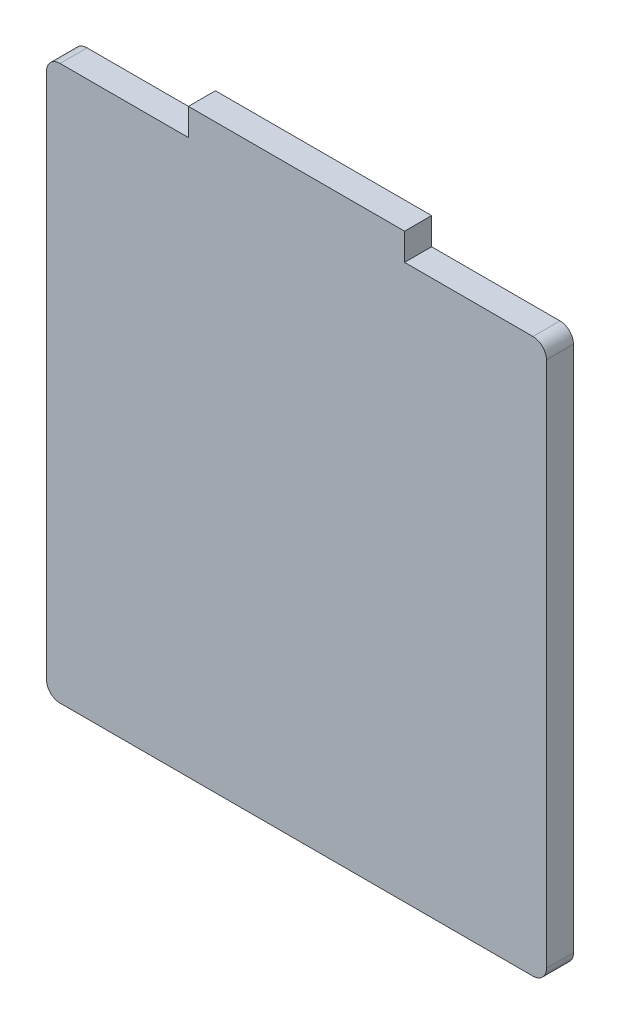
ISO-10303-21;
HEADER;
FILE_DESCRIPTION(('STEP AP214'),'2;1');
FILE_NAME('part.step','',(''),(''),'','','');
FILE_SCHEMA(('AUTOMOTIVE_DESIGN { 1 0 10303 214 1 1 1 1 }'));
ENDSEC;
DATA;
#1=APPLICATION_CONTEXT('core data for automotive mechanical design processes');
#2=APPLICATION_PROTOCOL_DEFINITION('international standard','automotive_design',2000,#1);
#3=PRODUCT_CONTEXT('',#1,'mechanical');
#4=PRODUCT('Part','Part','',(#3));
#5=PRODUCT_RELATED_PRODUCT_CATEGORY('part','',(#4));
#6=PRODUCT_DEFINITION_FORMATION('','',#4);
#7=PRODUCT_DEFINITION_CONTEXT('part definition',#1,'design');
#8=PRODUCT_DEFINITION('design','',#6,#7);
#9=PRODUCT_DEFINITION_SHAPE('','',#8);
#10=(LENGTH_UNIT() NAMED_UNIT(*) SI_UNIT(.MILLI.,.METRE.));
#11=(NAMED_UNIT(*) PLANE_ANGLE_UNIT() SI_UNIT($,.RADIAN.));
#12=(NAMED_UNIT(*) SI_UNIT($,.STERADIAN.) SOLID_ANGLE_UNIT());
#13=UNCERTAINTY_MEASURE_WITH_UNIT(LENGTH_MEASURE(1.E-05),#10,'distance_accuracy_value','');
#14=(GEOMETRIC_REPRESENTATION_CONTEXT(3) GLOBAL_UNCERTAINTY_ASSIGNED_CONTEXT((#13)) GLOBAL_UNIT_ASSIGNED_CONTEXT((#10,
#11,#12)) REPRESENTATION_CONTEXT('',''));
#15=CARTESIAN_POINT('',(0.,0.,0.));
#16=DIRECTION('',(0.,0.,1.));
#17=DIRECTION('',(1.,0.,0.));
#18=AXIS2_PLACEMENT_3D('',#15,#16,#17);
#19=CARTESIAN_POINT('',(-58.7375,-65.0875,6.35));
#20=DIRECTION('',(-1.,0.,0.));
#21=DIRECTION('',(0.,0.,1.));
#22=AXIS2_PLACEMENT_3D('',#19,#20,#21);
#23=PLANE('',#22);
#24=DIRECTION('',(0.,1.,0.));
#25=VECTOR('',#24,1.);
#26=CARTESIAN_POINT('',(-58.7375,-65.0875,0.));
#27=LINE('',#26,#25);
#28=CARTESIAN_POINT('',(-58.7375,-61.9125,0.));
#29=VERTEX_POINT('',#28);
#30=CARTESIAN_POINT('',(-58.7375,61.9125,0.));
#31=VERTEX_POINT('',#30);
#32=EDGE_CURVE('E161',#29,#31,#27,.T.);
#33=ORIENTED_EDGE('',*,*,#32,.F.);
#34=DIRECTION('',(0.,0.,-1.));
#35=VECTOR('',#34,1.);
#36=CARTESIAN_POINT('',(-58.7375,-61.9125,6.35));
#37=LINE('',#36,#35);
#38=CARTESIAN_POINT('',(-58.7375,-61.9125,6.35));
#39=VERTEX_POINT('',#38);
#40=EDGE_CURVE('E203',#29,#39,#37,.F.);
#41=ORIENTED_EDGE('',*,*,#40,.T.);
#42=DIRECTION('',(0.,1.,0.));
#43=VECTOR('',#42,1.);
#44=CARTESIAN_POINT('',(-58.7375,-65.0875,6.35));
#45=LINE('',#44,#43);
#46=CARTESIAN_POINT('',(-58.7375,61.9125,6.35));
#47=VERTEX_POINT('',#46);
#48=EDGE_CURVE('E134',#39,#47,#45,.T.);
#49=ORIENTED_EDGE('',*,*,#48,.T.);
#50=DIRECTION('',(0.,0.,-1.));
#51=VECTOR('',#50,1.);
#52=CARTESIAN_POINT('',(-58.7375,61.9125,6.35));
#53=LINE('',#52,#51);
#54=EDGE_CURVE('E200',#47,#31,#53,.T.);
#55=ORIENTED_EDGE('',*,*,#54,.T.);
#56=EDGE_LOOP('',(#33,#41,#49,#55));
#57=FACE_BOUND('',#56,.T.);
#58=ADVANCED_FACE('F38',(#57),#23,.T.);
#59=CARTESIAN_POINT('',(-58.7375,-65.0875,6.35));
#60=DIRECTION('',(0.,1.,0.));
#61=DIRECTION('',(0.,0.,1.));
#62=AXIS2_PLACEMENT_3D('',#59,#60,#61);
#63=PLANE('',#62);
#64=DIRECTION('',(1.,0.,0.));
#65=VECTOR('',#64,1.);
#66=CARTESIAN_POINT('',(-58.7375,-65.0875,6.35));
#67=LINE('',#66,#65);
#68=CARTESIAN_POINT('',(-55.5625,-65.0875,6.35));
#69=VERTEX_POINT('',#68);
#70=CARTESIAN_POINT('',(55.5625,-65.0875,6.35));
#71=VERTEX_POINT('',#70);
#72=EDGE_CURVE('E142',#69,#71,#67,.T.);
#73=ORIENTED_EDGE('',*,*,#72,.F.);
#74=DIRECTION('',(0.,0.,-1.));
#75=VECTOR('',#74,1.);
#76=CARTESIAN_POINT('',(-55.5625,-65.0875,0.));
#77=LINE('',#76,#75);
#78=CARTESIAN_POINT('',(-55.5625,-65.0875,0.));
#79=VERTEX_POINT('',#78);
#80=EDGE_CURVE('E189',#69,#79,#77,.T.);
#81=ORIENTED_EDGE('',*,*,#80,.T.);
#82=DIRECTION('',(1.,0.,0.));
#83=VECTOR('',#82,1.);
#84=CARTESIAN_POINT('',(-58.7375,-65.0875,0.));
#85=LINE('',#84,#83);
#86=CARTESIAN_POINT('',(55.5625,-65.0875,0.));
#87=VERTEX_POINT('',#86);
#88=EDGE_CURVE('E179',#79,#87,#85,.T.);
#89=ORIENTED_EDGE('',*,*,#88,.T.);
#90=DIRECTION('',(0.,0.,-1.));
#91=VECTOR('',#90,1.);
#92=CARTESIAN_POINT('',(55.5625,-65.0875,6.35));
#93=LINE('',#92,#91);
#94=EDGE_CURVE('E184',#87,#71,#93,.F.);
#95=ORIENTED_EDGE('',*,*,#94,.T.);
#96=EDGE_LOOP('',(#73,#81,#89,#95));
#97=FACE_BOUND('',#96,.T.);
#98=ADVANCED_FACE('F247',(#97),#63,.F.);
#99=CARTESIAN_POINT('',(58.7375,-65.0875,6.35));
#100=DIRECTION('',(-1.,0.,0.));
#101=DIRECTION('',(0.,0.,1.));
#102=AXIS2_PLACEMENT_3D('',#99,#100,#101);
#103=PLANE('',#102);
#104=DIRECTION('',(0.,1.,0.));
#105=VECTOR('',#104,1.);
#106=CARTESIAN_POINT('',(58.7375,-65.0875,6.35));
#107=LINE('',#106,#105);
#108=CARTESIAN_POINT('',(58.7375,-61.9125,6.35));
#109=VERTEX_POINT('',#108);
#110=CARTESIAN_POINT('',(58.7375,61.9125,6.35));
#111=VERTEX_POINT('',#110);
#112=EDGE_CURVE('E157',#109,#111,#107,.T.);
#113=ORIENTED_EDGE('',*,*,#112,.F.);
#114=DIRECTION('',(0.,0.,-1.));
#115=VECTOR('',#114,1.);
#116=CARTESIAN_POINT('',(58.7375,-61.9125,6.35));
#117=LINE('',#116,#115);
#118=CARTESIAN_POINT('',(58.7375,-61.9125,0.));
#119=VERTEX_POINT('',#118);
#120=EDGE_CURVE('E214',#109,#119,#117,.T.);
#121=ORIENTED_EDGE('',*,*,#120,.T.);
#122=DIRECTION('',(0.,1.,0.));
#123=VECTOR('',#122,1.);
#124=CARTESIAN_POINT('',(58.7375,-65.0875,0.));
#125=LINE('',#124,#123);
#126=CARTESIAN_POINT('',(58.7375,61.9125,0.));
#127=VERTEX_POINT('',#126);
#128=EDGE_CURVE('E176',#119,#127,#125,.T.);
#129=ORIENTED_EDGE('',*,*,#128,.T.);
#130=DIRECTION('',(0.,0.,-1.));
#131=VECTOR('',#130,1.);
#132=CARTESIAN_POINT('',(58.7375,61.9125,6.35));
#133=LINE('',#132,#131);
#134=EDGE_CURVE('E212',#127,#111,#133,.F.);
#135=ORIENTED_EDGE('',*,*,#134,.T.);
#136=EDGE_LOOP('',(#113,#121,#129,#135));
#137=FACE_BOUND('',#136,.T.);
#138=ADVANCED_FACE('F254',(#137),#103,.F.);
#139=CARTESIAN_POINT('',(25.4,65.0875,6.35));
#140=DIRECTION('',(0.,1.,0.));
#141=DIRECTION('',(0.,0.,1.));
#142=AXIS2_PLACEMENT_3D('',#139,#140,#141);
#143=PLANE('',#142);
#144=DIRECTION('',(1.,0.,0.));
#145=VECTOR('',#144,1.);
#146=CARTESIAN_POINT('',(25.4,65.0875,6.35));
#147=LINE('',#146,#145);
#148=CARTESIAN_POINT('',(25.4,65.0875,6.35));
#149=VERTEX_POINT('',#148);
#150=CARTESIAN_POINT('',(55.5625,65.0875,6.35));
#151=VERTEX_POINT('',#150);
#152=EDGE_CURVE('E155',#149,#151,#147,.T.);
#153=ORIENTED_EDGE('',*,*,#152,.T.);
#154=DIRECTION('',(0.,0.,-1.));
#155=VECTOR('',#154,1.);
#156=CARTESIAN_POINT('',(55.5625,65.0875,0.));
#157=LINE('',#156,#155);
#158=CARTESIAN_POINT('',(55.5625,65.0875,0.));
#159=VERTEX_POINT('',#158);
#160=EDGE_CURVE('E46',#151,#159,#157,.T.);
#161=ORIENTED_EDGE('',*,*,#160,.T.);
#162=DIRECTION('',(1.,0.,0.));
#163=VECTOR('',#162,1.);
#164=CARTESIAN_POINT('',(25.4,65.0875,0.));
#165=LINE('',#164,#163);
#166=CARTESIAN_POINT('',(25.4,65.0875,0.));
#167=VERTEX_POINT('',#166);
#168=EDGE_CURVE('E173',#167,#159,#165,.T.);
#169=ORIENTED_EDGE('',*,*,#168,.F.);
#170=DIRECTION('',(0.,0.,-1.));
#171=VECTOR('',#170,1.);
#172=CARTESIAN_POINT('',(25.4,65.0875,6.35));
#173=LINE('',#172,#171);
#174=EDGE_CURVE('E182',#149,#167,#173,.T.);
#175=ORIENTED_EDGE('',*,*,#174,.F.);
#176=EDGE_LOOP('',(#153,#161,#169,#175));
#177=FACE_BOUND('',#176,.T.);
#178=ADVANCED_FACE('F220',(#177),#143,.T.);
#179=CARTESIAN_POINT('',(25.4,65.0875,6.35));
#180=DIRECTION('',(-1.,0.,0.));
#181=DIRECTION('',(0.,0.,1.));
#182=AXIS2_PLACEMENT_3D('',#179,#180,#181);
#183=PLANE('',#182);
#184=DIRECTION('',(0.,1.,0.));
#185=VECTOR('',#184,1.);
#186=CARTESIAN_POINT('',(25.4,65.0875,0.));
#187=LINE('',#186,#185);
#188=CARTESIAN_POINT('',(25.4,71.4375,0.));
#189=VERTEX_POINT('',#188);
#190=EDGE_CURVE('E170',#167,#189,#187,.T.);
#191=ORIENTED_EDGE('',*,*,#190,.T.);
#192=DIRECTION('',(0.,0.,-1.));
#193=VECTOR('',#192,1.);
#194=CARTESIAN_POINT('',(25.4,71.4375,6.35));
#195=LINE('',#194,#193);
#196=CARTESIAN_POINT('',(25.4,71.4375,6.35));
#197=VERTEX_POINT('',#196);
#198=EDGE_CURVE('E185',#197,#189,#195,.T.);
#199=ORIENTED_EDGE('',*,*,#198,.F.);
#200=DIRECTION('',(0.,1.,0.));
#201=VECTOR('',#200,1.);
#202=CARTESIAN_POINT('',(25.4,65.0875,6.35));
#203=LINE('',#202,#201);
#204=EDGE_CURVE('E150',#149,#197,#203,.T.);
#205=ORIENTED_EDGE('',*,*,#204,.F.);
#206=ORIENTED_EDGE('',*,*,#174,.T.);
#207=EDGE_LOOP('',(#191,#199,#205,#206));
#208=FACE_BOUND('',#207,.T.);
#209=ADVANCED_FACE('F230',(#208),#183,.F.);
#210=CARTESIAN_POINT('',(-25.4,71.4375,6.35));
#211=DIRECTION('',(0.,1.,0.));
#212=DIRECTION('',(-1.,0.,0.));
#213=AXIS2_PLACEMENT_3D('',#210,#211,#212);
#214=PLANE('',#213);
#215=DIRECTION('',(1.,0.,0.));
#216=VECTOR('',#215,1.);
#217=CARTESIAN_POINT('',(-25.4,71.4375,0.));
#218=LINE('',#217,#216);
#219=CARTESIAN_POINT('',(-25.4,71.4375,0.));
#220=VERTEX_POINT('',#219);
#221=EDGE_CURVE('E167',#220,#189,#218,.T.);
#222=ORIENTED_EDGE('',*,*,#221,.F.);
#223=DIRECTION('',(0.,0.,-1.));
#224=VECTOR('',#223,1.);
#225=CARTESIAN_POINT('',(-25.4,71.4375,6.35));
#226=LINE('',#225,#224);
#227=CARTESIAN_POINT('',(-25.4,71.4375,6.35));
#228=VERTEX_POINT('',#227);
#229=EDGE_CURVE('E141',#228,#220,#226,.T.);
#230=ORIENTED_EDGE('',*,*,#229,.F.);
#231=DIRECTION('',(1.,0.,0.));
#232=VECTOR('',#231,1.);
#233=CARTESIAN_POINT('',(-25.4,71.4375,6.35));
#234=LINE('',#233,#232);
#235=EDGE_CURVE('E148',#228,#197,#234,.T.);
#236=ORIENTED_EDGE('',*,*,#235,.T.);
#237=ORIENTED_EDGE('',*,*,#198,.T.);
#238=EDGE_LOOP('',(#222,#230,#236,#237));
#239=FACE_BOUND('',#238,.T.);
#240=ADVANCED_FACE('F233',(#239),#214,.T.);
#241=CARTESIAN_POINT('',(-25.4,65.0875,6.35));
#242=DIRECTION('',(-1.,0.,0.));
#243=DIRECTION('',(0.,0.,1.));
#244=AXIS2_PLACEMENT_3D('',#241,#242,#243);
#245=PLANE('',#244);
#246=DIRECTION('',(0.,1.,0.));
#247=VECTOR('',#246,1.);
#248=CARTESIAN_POINT('',(-25.4,65.0875,0.));
#249=LINE('',#248,#247);
#250=CARTESIAN_POINT('',(-25.4,65.0875,0.));
#251=VERTEX_POINT('',#250);
#252=EDGE_CURVE('E140',#251,#220,#249,.T.);
#253=ORIENTED_EDGE('',*,*,#252,.F.);
#254=DIRECTION('',(0.,0.,-1.));
#255=VECTOR('',#254,1.);
#256=CARTESIAN_POINT('',(-25.4,65.0875,6.35));
#257=LINE('',#256,#255);
#258=CARTESIAN_POINT('',(-25.4,65.0875,6.35));
#259=VERTEX_POINT('',#258);
#260=EDGE_CURVE('E129',#259,#251,#257,.T.);
#261=ORIENTED_EDGE('',*,*,#260,.F.);
#262=DIRECTION('',(0.,1.,0.));
#263=VECTOR('',#262,1.);
#264=CARTESIAN_POINT('',(-25.4,65.0875,6.35));
#265=LINE('',#264,#263);
#266=EDGE_CURVE('E133',#259,#228,#265,.T.);
#267=ORIENTED_EDGE('',*,*,#266,.T.);
#268=ORIENTED_EDGE('',*,*,#229,.T.);
#269=EDGE_LOOP('',(#253,#261,#267,#268));
#270=FACE_BOUND('',#269,.T.);
#271=ADVANCED_FACE('F138',(#270),#245,.T.);
#272=CARTESIAN_POINT('',(-58.7375,65.0875,6.35));
#273=DIRECTION('',(0.,1.,0.));
#274=DIRECTION('',(0.,0.,1.));
#275=AXIS2_PLACEMENT_3D('',#272,#273,#274);
#276=PLANE('',#275);
#277=DIRECTION('',(1.,0.,0.));
#278=VECTOR('',#277,1.);
#279=CARTESIAN_POINT('',(-58.7375,65.0875,0.));
#280=LINE('',#279,#278);
#281=CARTESIAN_POINT('',(-55.5625,65.0875,0.));
#282=VERTEX_POINT('',#281);
#283=EDGE_CURVE('E164',#282,#251,#280,.T.);
#284=ORIENTED_EDGE('',*,*,#283,.F.);
#285=DIRECTION('',(0.,0.,-1.));
#286=VECTOR('',#285,1.);
#287=CARTESIAN_POINT('',(-55.5625,65.0875,6.35));
#288=LINE('',#287,#286);
#289=CARTESIAN_POINT('',(-55.5625,65.0875,6.35));
#290=VERTEX_POINT('',#289);
#291=EDGE_CURVE('E11',#282,#290,#288,.F.);
#292=ORIENTED_EDGE('',*,*,#291,.T.);
#293=DIRECTION('',(1.,0.,0.));
#294=VECTOR('',#293,1.);
#295=CARTESIAN_POINT('',(-58.7375,65.0875,6.35));
#296=LINE('',#295,#294);
#297=EDGE_CURVE('E126',#290,#259,#296,.T.);
#298=ORIENTED_EDGE('',*,*,#297,.T.);
#299=ORIENTED_EDGE('',*,*,#260,.T.);
#300=EDGE_LOOP('',(#284,#292,#298,#299));
#301=FACE_BOUND('',#300,.T.);
#302=ADVANCED_FACE('F128',(#301),#276,.T.);
#303=CARTESIAN_POINT('',(0.,0.,6.35));
#304=DIRECTION('',(0.,0.,-1.));
#305=DIRECTION('',(-1.,0.,0.));
#306=AXIS2_PLACEMENT_3D('',#303,#304,#305);
#307=PLANE('',#306);
#308=ORIENTED_EDGE('',*,*,#48,.F.);
#309=CARTESIAN_POINT('',(-55.5625,-61.9125,6.35));
#310=DIRECTION('',(0.,0.,-1.));
#311=DIRECTION('',(-1.,0.,0.));
#312=AXIS2_PLACEMENT_3D('',#309,#310,#311);
#313=CIRCLE('',#312,3.175);
#314=EDGE_CURVE('E210',#39,#69,#313,.F.);
#315=ORIENTED_EDGE('',*,*,#314,.T.);
#316=ORIENTED_EDGE('',*,*,#72,.T.);
#317=CARTESIAN_POINT('',(55.5625,-61.9125,6.35));
#318=DIRECTION('',(0.,0.,-1.));
#319=DIRECTION('',(-1.,0.,0.));
#320=AXIS2_PLACEMENT_3D('',#317,#318,#319);
#321=CIRCLE('',#320,3.175);
#322=EDGE_CURVE('E208',#71,#109,#321,.F.);
#323=ORIENTED_EDGE('',*,*,#322,.T.);
#324=ORIENTED_EDGE('',*,*,#112,.T.);
#325=CARTESIAN_POINT('',(55.5625,61.9125,6.35));
#326=DIRECTION('',(0.,0.,-1.));
#327=DIRECTION('',(-1.,0.,0.));
#328=AXIS2_PLACEMENT_3D('',#325,#326,#327);
#329=CIRCLE('',#328,3.175);
#330=EDGE_CURVE('E59',#111,#151,#329,.F.);
#331=ORIENTED_EDGE('',*,*,#330,.T.);
#332=ORIENTED_EDGE('',*,*,#152,.F.);
#333=ORIENTED_EDGE('',*,*,#204,.T.);
#334=ORIENTED_EDGE('',*,*,#235,.F.);
#335=ORIENTED_EDGE('',*,*,#266,.F.);
#336=ORIENTED_EDGE('',*,*,#297,.F.);
#337=CARTESIAN_POINT('',(-55.5625,61.9125,6.35));
#338=DIRECTION('',(0.,0.,-1.));
#339=DIRECTION('',(-1.,0.,0.));
#340=AXIS2_PLACEMENT_3D('',#337,#338,#339);
#341=CIRCLE('',#340,3.175);
#342=EDGE_CURVE('E205',#290,#47,#341,.F.);
#343=ORIENTED_EDGE('',*,*,#342,.T.);
#344=EDGE_LOOP('',(#308,#315,#316,#323,#324,#331,#332,#333,#334,#335,#336,#343));
#345=FACE_BOUND('',#344,.T.);
#346=ADVANCED_FACE('F146',(#345),#307,.F.);
#347=CARTESIAN_POINT('',(0.,0.,0.));
#348=DIRECTION('',(0.,0.,-1.));
#349=DIRECTION('',(-1.,0.,0.));
#350=AXIS2_PLACEMENT_3D('',#347,#348,#349);
#351=PLANE('',#350);
#352=ORIENTED_EDGE('',*,*,#88,.F.);
#353=CARTESIAN_POINT('',(-55.5625,-61.9125,0.));
#354=DIRECTION('',(0.,0.,-1.));
#355=DIRECTION('',(-1.,0.,0.));
#356=AXIS2_PLACEMENT_3D('',#353,#354,#355);
#357=CIRCLE('',#356,3.175);
#358=EDGE_CURVE('E198',#79,#29,#357,.T.);
#359=ORIENTED_EDGE('',*,*,#358,.T.);
#360=ORIENTED_EDGE('',*,*,#32,.T.);
#361=CARTESIAN_POINT('',(-55.5625,61.9125,0.));
#362=DIRECTION('',(0.,0.,-1.));
#363=DIRECTION('',(-1.,0.,0.));
#364=AXIS2_PLACEMENT_3D('',#361,#362,#363);
#365=CIRCLE('',#364,3.175);
#366=EDGE_CURVE('E192',#31,#282,#365,.T.);
#367=ORIENTED_EDGE('',*,*,#366,.T.);
#368=ORIENTED_EDGE('',*,*,#283,.T.);
#369=ORIENTED_EDGE('',*,*,#252,.T.);
#370=ORIENTED_EDGE('',*,*,#221,.T.);
#371=ORIENTED_EDGE('',*,*,#190,.F.);
#372=ORIENTED_EDGE('',*,*,#168,.T.);
#373=CARTESIAN_POINT('',(55.5625,61.9125,0.));
#374=DIRECTION('',(0.,0.,-1.));
#375=DIRECTION('',(-1.,0.,0.));
#376=AXIS2_PLACEMENT_3D('',#373,#374,#375);
#377=CIRCLE('',#376,3.175);
#378=EDGE_CURVE('E194',#159,#127,#377,.T.);
#379=ORIENTED_EDGE('',*,*,#378,.T.);
#380=ORIENTED_EDGE('',*,*,#128,.F.);
#381=CARTESIAN_POINT('',(55.5625,-61.9125,0.));
#382=DIRECTION('',(0.,0.,-1.));
#383=DIRECTION('',(-1.,0.,0.));
#384=AXIS2_PLACEMENT_3D('',#381,#382,#383);
#385=CIRCLE('',#384,3.175);
#386=EDGE_CURVE('E196',#119,#87,#385,.T.);
#387=ORIENTED_EDGE('',*,*,#386,.T.);
#388=EDGE_LOOP('',(#352,#359,#360,#367,#368,#369,#370,#371,#372,#379,#380,#387));
#389=FACE_BOUND('',#388,.T.);
#390=ADVANCED_FACE('F225',(#389),#351,.T.);
#391=CARTESIAN_POINT('',(-55.5625,-61.9125,6.35));
#392=DIRECTION('',(0.,0.,1.));
#393=DIRECTION('',(1.,0.,0.));
#394=AXIS2_PLACEMENT_3D('',#391,#392,#393);
#395=CYLINDRICAL_SURFACE('',#394,3.175);
#396=ORIENTED_EDGE('',*,*,#314,.F.);
#397=ORIENTED_EDGE('',*,*,#40,.F.);
#398=ORIENTED_EDGE('',*,*,#358,.F.);
#399=ORIENTED_EDGE('',*,*,#80,.F.);
#400=EDGE_LOOP('',(#396,#397,#398,#399));
#401=FACE_BOUND('',#400,.T.);
#402=ADVANCED_FACE('F242',(#401),#395,.T.);
#403=CARTESIAN_POINT('',(55.5625,-61.9125,6.35));
#404=DIRECTION('',(0.,0.,-1.));
#405=DIRECTION('',(-1.,0.,0.));
#406=AXIS2_PLACEMENT_3D('',#403,#404,#405);
#407=CYLINDRICAL_SURFACE('',#406,3.175);
#408=ORIENTED_EDGE('',*,*,#322,.F.);
#409=ORIENTED_EDGE('',*,*,#94,.F.);
#410=ORIENTED_EDGE('',*,*,#386,.F.);
#411=ORIENTED_EDGE('',*,*,#120,.F.);
#412=EDGE_LOOP('',(#408,#409,#410,#411));
#413=FACE_BOUND('',#412,.T.);
#414=ADVANCED_FACE('F250',(#413),#407,.T.);
#415=CARTESIAN_POINT('',(55.5625,61.9125,6.35));
#416=DIRECTION('',(0.,0.,1.));
#417=DIRECTION('',(1.,0.,0.));
#418=AXIS2_PLACEMENT_3D('',#415,#416,#417);
#419=CYLINDRICAL_SURFACE('',#418,3.175);
#420=ORIENTED_EDGE('',*,*,#330,.F.);
#421=ORIENTED_EDGE('',*,*,#134,.F.);
#422=ORIENTED_EDGE('',*,*,#378,.F.);
#423=ORIENTED_EDGE('',*,*,#160,.F.);
#424=EDGE_LOOP('',(#420,#421,#422,#423));
#425=FACE_BOUND('',#424,.T.);
#426=ADVANCED_FACE('F256',(#425),#419,.T.);
#427=CARTESIAN_POINT('',(-55.5625,61.9125,6.35));
#428=DIRECTION('',(0.,0.,-1.));
#429=DIRECTION('',(-1.,0.,0.));
#430=AXIS2_PLACEMENT_3D('',#427,#428,#429);
#431=CYLINDRICAL_SURFACE('',#430,3.175);
#432=ORIENTED_EDGE('',*,*,#342,.F.);
#433=ORIENTED_EDGE('',*,*,#291,.F.);
#434=ORIENTED_EDGE('',*,*,#366,.F.);
#435=ORIENTED_EDGE('',*,*,#54,.F.);
#436=EDGE_LOOP('',(#432,#433,#434,#435));
#437=FACE_BOUND('',#436,.T.);
#438=ADVANCED_FACE('F40',(#437),#431,.T.);
#439=CLOSED_SHELL('',(#58,#98,#138,#178,#209,#240,#271,#302,#346,#390,#402,#414,#426,#438));
#440=MANIFOLD_SOLID_BREP('B2',#439);
#441=ADVANCED_BREP_SHAPE_REPRESENTATION('',(#18,#440),#14);
#442=SHAPE_DEFINITION_REPRESENTATION(#9,#441);
ENDSEC;
END-ISO-10303-21;
